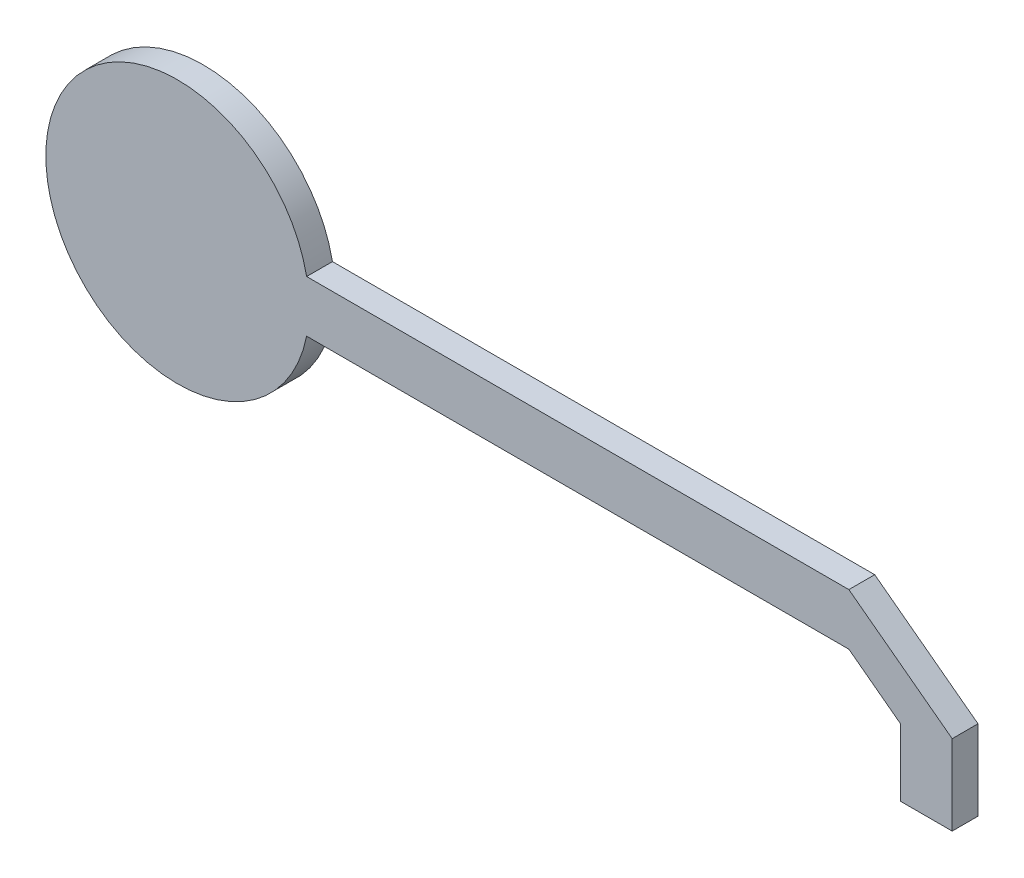
ISO-10303-21;
HEADER;
FILE_DESCRIPTION(('STEP AP214'),'2;1');
FILE_NAME('part.step','',(''),(''),'','','');
FILE_SCHEMA(('AUTOMOTIVE_DESIGN { 1 0 10303 214 1 1 1 1 }'));
ENDSEC;
DATA;
#1=APPLICATION_CONTEXT('core data for automotive mechanical design processes');
#2=APPLICATION_PROTOCOL_DEFINITION('international standard','automotive_design',2000,#1);
#3=PRODUCT_CONTEXT('',#1,'mechanical');
#4=PRODUCT('Part','Part','',(#3));
#5=PRODUCT_RELATED_PRODUCT_CATEGORY('part','',(#4));
#6=PRODUCT_DEFINITION_FORMATION('','',#4);
#7=PRODUCT_DEFINITION_CONTEXT('part definition',#1,'design');
#8=PRODUCT_DEFINITION('design','',#6,#7);
#9=PRODUCT_DEFINITION_SHAPE('','',#8);
#10=(LENGTH_UNIT() NAMED_UNIT(*) SI_UNIT(.MILLI.,.METRE.));
#11=(NAMED_UNIT(*) PLANE_ANGLE_UNIT() SI_UNIT($,.RADIAN.));
#12=(NAMED_UNIT(*) SI_UNIT($,.STERADIAN.) SOLID_ANGLE_UNIT());
#13=UNCERTAINTY_MEASURE_WITH_UNIT(LENGTH_MEASURE(1.E-05),#10,'distance_accuracy_value','');
#14=(GEOMETRIC_REPRESENTATION_CONTEXT(3) GLOBAL_UNCERTAINTY_ASSIGNED_CONTEXT((#13)) GLOBAL_UNIT_ASSIGNED_CONTEXT((#10,
#11,#12)) REPRESENTATION_CONTEXT('',''));
#15=CARTESIAN_POINT('',(0.,0.,0.));
#16=DIRECTION('',(0.,0.,1.));
#17=DIRECTION('',(1.,0.,0.));
#18=AXIS2_PLACEMENT_3D('',#15,#16,#17);
#19=CARTESIAN_POINT('',(-77.5024997500499,0.,5.));
#20=DIRECTION('',(0.,0.,-1.));
#21=DIRECTION('',(-1.,0.,0.));
#22=AXIS2_PLACEMENT_3D('',#19,#20,#21);
#23=CYLINDRICAL_SURFACE('',#22,25.5);
#24=CARTESIAN_POINT('',(-77.5024997500499,0.,0.));
#25=DIRECTION('',(0.,0.,1.));
#26=DIRECTION('',(1.,0.,0.));
#27=AXIS2_PLACEMENT_3D('',#24,#25,#26);
#28=CIRCLE('',#27,25.5);
#29=CARTESIAN_POINT('',(-52.4975002499499,5.,0.));
#30=VERTEX_POINT('',#29);
#31=CARTESIAN_POINT('',(-52.4975002499499,-5.,0.));
#32=VERTEX_POINT('',#31);
#33=EDGE_CURVE('E141',#30,#32,#28,.T.);
#34=ORIENTED_EDGE('',*,*,#33,.T.);
#35=DIRECTION('',(0.,0.,-1.));
#36=VECTOR('',#35,1.);
#37=CARTESIAN_POINT('',(-52.4975002499499,-5.,5.));
#38=LINE('',#37,#36);
#39=CARTESIAN_POINT('',(-52.4975002499499,-5.,5.));
#40=VERTEX_POINT('',#39);
#41=EDGE_CURVE('E183',#40,#32,#38,.T.);
#42=ORIENTED_EDGE('',*,*,#41,.F.);
#43=CARTESIAN_POINT('',(-77.5024997500499,0.,5.));
#44=DIRECTION('',(0.,0.,1.));
#45=DIRECTION('',(1.,0.,0.));
#46=AXIS2_PLACEMENT_3D('',#43,#44,#45);
#47=CIRCLE('',#46,25.5);
#48=CARTESIAN_POINT('',(-52.4975002499499,5.,5.));
#49=VERTEX_POINT('',#48);
#50=EDGE_CURVE('E164',#49,#40,#47,.T.);
#51=ORIENTED_EDGE('',*,*,#50,.F.);
#52=DIRECTION('',(0.,0.,-1.));
#53=VECTOR('',#52,1.);
#54=CARTESIAN_POINT('',(-52.4975002499499,5.,5.));
#55=LINE('',#54,#53);
#56=EDGE_CURVE('E137',#49,#30,#55,.T.);
#57=ORIENTED_EDGE('',*,*,#56,.T.);
#58=EDGE_LOOP('',(#34,#42,#51,#57));
#59=FACE_BOUND('',#58,.T.);
#60=ADVANCED_FACE('F39',(#59),#23,.T.);
#61=CARTESIAN_POINT('',(52.4975002499501,-5.,5.));
#62=DIRECTION('',(0.,1.,0.));
#63=DIRECTION('',(0.,0.,1.));
#64=AXIS2_PLACEMENT_3D('',#61,#62,#63);
#65=PLANE('',#64);
#66=DIRECTION('',(1.,0.,0.));
#67=VECTOR('',#66,1.);
#68=CARTESIAN_POINT('',(52.4975002499501,-5.,0.));
#69=LINE('',#68,#67);
#70=CARTESIAN_POINT('',(52.4975002499501,-5.,0.));
#71=VERTEX_POINT('',#70);
#72=EDGE_CURVE('E145',#32,#71,#69,.T.);
#73=ORIENTED_EDGE('',*,*,#72,.T.);
#74=DIRECTION('',(0.,0.,-1.));
#75=VECTOR('',#74,1.);
#76=CARTESIAN_POINT('',(52.4975002499501,-5.,5.));
#77=LINE('',#76,#75);
#78=CARTESIAN_POINT('',(52.4975002499501,-5.,5.));
#79=VERTEX_POINT('',#78);
#80=EDGE_CURVE('E179',#79,#71,#77,.T.);
#81=ORIENTED_EDGE('',*,*,#80,.F.);
#82=DIRECTION('',(1.,0.,0.));
#83=VECTOR('',#82,1.);
#84=CARTESIAN_POINT('',(52.4975002499501,-5.,5.));
#85=LINE('',#84,#83);
#86=EDGE_CURVE('E100',#40,#79,#85,.T.);
#87=ORIENTED_EDGE('',*,*,#86,.F.);
#88=ORIENTED_EDGE('',*,*,#41,.T.);
#89=EDGE_LOOP('',(#73,#81,#87,#88));
#90=FACE_BOUND('',#89,.T.);
#91=ADVANCED_FACE('F211',(#90),#65,.F.);
#92=CARTESIAN_POINT('',(52.4975002499501,-5.,5.));
#93=DIRECTION('',(0.6,0.8,0.));
#94=DIRECTION('',(-0.8,0.6,0.));
#95=AXIS2_PLACEMENT_3D('',#92,#93,#94);
#96=PLANE('',#95);
#97=DIRECTION('',(0.8,-0.6,0.));
#98=VECTOR('',#97,1.);
#99=CARTESIAN_POINT('',(52.4975002499501,-5.,0.));
#100=LINE('',#99,#98);
#101=CARTESIAN_POINT('',(62.4975002499501,-12.5,0.));
#102=VERTEX_POINT('',#101);
#103=EDGE_CURVE('E149',#71,#102,#100,.T.);
#104=ORIENTED_EDGE('',*,*,#103,.T.);
#105=DIRECTION('',(0.,0.,-1.));
#106=VECTOR('',#105,1.);
#107=CARTESIAN_POINT('',(62.4975002499501,-12.5,5.));
#108=LINE('',#107,#106);
#109=CARTESIAN_POINT('',(62.4975002499501,-12.5,5.));
#110=VERTEX_POINT('',#109);
#111=EDGE_CURVE('E175',#110,#102,#108,.T.);
#112=ORIENTED_EDGE('',*,*,#111,.F.);
#113=DIRECTION('',(0.8,-0.6,0.));
#114=VECTOR('',#113,1.);
#115=CARTESIAN_POINT('',(52.4975002499501,-5.,5.));
#116=LINE('',#115,#114);
#117=EDGE_CURVE('E311',#79,#110,#116,.T.);
#118=ORIENTED_EDGE('',*,*,#117,.F.);
#119=ORIENTED_EDGE('',*,*,#80,.T.);
#120=EDGE_LOOP('',(#104,#112,#118,#119));
#121=FACE_BOUND('',#120,.T.);
#122=ADVANCED_FACE('F215',(#121),#96,.F.);
#123=CARTESIAN_POINT('',(62.4975002499501,-25.5,5.));
#124=DIRECTION('',(1.,0.,0.));
#125=DIRECTION('',(0.,0.,-1.));
#126=AXIS2_PLACEMENT_3D('',#123,#124,#125);
#127=PLANE('',#126);
#128=DIRECTION('',(0.,-1.,0.));
#129=VECTOR('',#128,1.);
#130=CARTESIAN_POINT('',(62.4975002499501,-25.5,0.));
#131=LINE('',#130,#129);
#132=CARTESIAN_POINT('',(62.4975002499501,-25.5,0.));
#133=VERTEX_POINT('',#132);
#134=EDGE_CURVE('E152',#102,#133,#131,.T.);
#135=ORIENTED_EDGE('',*,*,#134,.T.);
#136=DIRECTION('',(0.,0.,-1.));
#137=VECTOR('',#136,1.);
#138=CARTESIAN_POINT('',(62.4975002499501,-25.5,5.));
#139=LINE('',#138,#137);
#140=CARTESIAN_POINT('',(62.4975002499501,-25.5,5.));
#141=VERTEX_POINT('',#140);
#142=EDGE_CURVE('E171',#141,#133,#139,.T.);
#143=ORIENTED_EDGE('',*,*,#142,.F.);
#144=DIRECTION('',(0.,-1.,0.));
#145=VECTOR('',#144,1.);
#146=CARTESIAN_POINT('',(62.4975002499501,-25.5,5.));
#147=LINE('',#146,#145);
#148=EDGE_CURVE('E314',#110,#141,#147,.T.);
#149=ORIENTED_EDGE('',*,*,#148,.F.);
#150=ORIENTED_EDGE('',*,*,#111,.T.);
#151=EDGE_LOOP('',(#135,#143,#149,#150));
#152=FACE_BOUND('',#151,.T.);
#153=ADVANCED_FACE('F219',(#152),#127,.F.);
#154=CARTESIAN_POINT('',(62.4975002499501,-25.5,5.));
#155=DIRECTION('',(0.,1.,0.));
#156=DIRECTION('',(0.,0.,1.));
#157=AXIS2_PLACEMENT_3D('',#154,#155,#156);
#158=PLANE('',#157);
#159=DIRECTION('',(1.,0.,0.));
#160=VECTOR('',#159,1.);
#161=CARTESIAN_POINT('',(62.4975002499501,-25.5,0.));
#162=LINE('',#161,#160);
#163=CARTESIAN_POINT('',(72.4975002499501,-25.5,0.));
#164=VERTEX_POINT('',#163);
#165=EDGE_CURVE('E155',#133,#164,#162,.T.);
#166=ORIENTED_EDGE('',*,*,#165,.T.);
#167=DIRECTION('',(0.,0.,-1.));
#168=VECTOR('',#167,1.);
#169=CARTESIAN_POINT('',(72.4975002499501,-25.5,5.));
#170=LINE('',#169,#168);
#171=CARTESIAN_POINT('',(72.4975002499501,-25.5,5.));
#172=VERTEX_POINT('',#171);
#173=EDGE_CURVE('E130',#172,#164,#170,.T.);
#174=ORIENTED_EDGE('',*,*,#173,.F.);
#175=DIRECTION('',(1.,0.,0.));
#176=VECTOR('',#175,1.);
#177=CARTESIAN_POINT('',(62.4975002499501,-25.5,5.));
#178=LINE('',#177,#176);
#179=EDGE_CURVE('E119',#141,#172,#178,.T.);
#180=ORIENTED_EDGE('',*,*,#179,.F.);
#181=ORIENTED_EDGE('',*,*,#142,.T.);
#182=EDGE_LOOP('',(#166,#174,#180,#181));
#183=FACE_BOUND('',#182,.T.);
#184=ADVANCED_FACE('F225',(#183),#158,.F.);
#185=CARTESIAN_POINT('',(72.4975002499501,-25.5,5.));
#186=DIRECTION('',(-1.,0.,0.));
#187=DIRECTION('',(0.,0.,1.));
#188=AXIS2_PLACEMENT_3D('',#185,#186,#187);
#189=PLANE('',#188);
#190=DIRECTION('',(0.,1.,0.));
#191=VECTOR('',#190,1.);
#192=CARTESIAN_POINT('',(72.4975002499501,-25.5,0.));
#193=LINE('',#192,#191);
#194=CARTESIAN_POINT('',(72.4975002499501,-10.,0.));
#195=VERTEX_POINT('',#194);
#196=EDGE_CURVE('E128',#164,#195,#193,.T.);
#197=ORIENTED_EDGE('',*,*,#196,.T.);
#198=DIRECTION('',(0.,0.,-1.));
#199=VECTOR('',#198,1.);
#200=CARTESIAN_POINT('',(72.4975002499501,-10.,5.));
#201=LINE('',#200,#199);
#202=CARTESIAN_POINT('',(72.4975002499501,-10.,5.));
#203=VERTEX_POINT('',#202);
#204=EDGE_CURVE('E125',#203,#195,#201,.T.);
#205=ORIENTED_EDGE('',*,*,#204,.F.);
#206=DIRECTION('',(0.,1.,0.));
#207=VECTOR('',#206,1.);
#208=CARTESIAN_POINT('',(72.4975002499501,-25.5,5.));
#209=LINE('',#208,#207);
#210=EDGE_CURVE('E113',#172,#203,#209,.T.);
#211=ORIENTED_EDGE('',*,*,#210,.F.);
#212=ORIENTED_EDGE('',*,*,#173,.T.);
#213=EDGE_LOOP('',(#197,#205,#211,#212));
#214=FACE_BOUND('',#213,.T.);
#215=ADVANCED_FACE('F126',(#214),#189,.F.);
#216=CARTESIAN_POINT('',(72.4975002499501,-10.,5.));
#217=DIRECTION('',(-0.6,-0.8,0.));
#218=DIRECTION('',(0.8,-0.6,0.));
#219=AXIS2_PLACEMENT_3D('',#216,#217,#218);
#220=PLANE('',#219);
#221=DIRECTION('',(-0.8,0.6,0.));
#222=VECTOR('',#221,1.);
#223=CARTESIAN_POINT('',(72.4975002499501,-10.,0.));
#224=LINE('',#223,#222);
#225=CARTESIAN_POINT('',(52.4975002499501,5.,0.));
#226=VERTEX_POINT('',#225);
#227=EDGE_CURVE('E85',#195,#226,#224,.T.);
#228=ORIENTED_EDGE('',*,*,#227,.T.);
#229=DIRECTION('',(0.,0.,-1.));
#230=VECTOR('',#229,1.);
#231=CARTESIAN_POINT('',(52.4975002499501,5.,5.));
#232=LINE('',#231,#230);
#233=CARTESIAN_POINT('',(52.4975002499501,5.,5.));
#234=VERTEX_POINT('',#233);
#235=EDGE_CURVE('E131',#234,#226,#232,.T.);
#236=ORIENTED_EDGE('',*,*,#235,.F.);
#237=DIRECTION('',(-0.8,0.6,0.));
#238=VECTOR('',#237,1.);
#239=CARTESIAN_POINT('',(72.4975002499501,-10.,5.));
#240=LINE('',#239,#238);
#241=EDGE_CURVE('E117',#203,#234,#240,.T.);
#242=ORIENTED_EDGE('',*,*,#241,.F.);
#243=ORIENTED_EDGE('',*,*,#204,.T.);
#244=EDGE_LOOP('',(#228,#236,#242,#243));
#245=FACE_BOUND('',#244,.T.);
#246=ADVANCED_FACE('F133',(#245),#220,.F.);
#247=CARTESIAN_POINT('',(-52.4975002499499,5.,5.));
#248=DIRECTION('',(0.,-1.,0.));
#249=DIRECTION('',(0.,0.,-1.));
#250=AXIS2_PLACEMENT_3D('',#247,#248,#249);
#251=PLANE('',#250);
#252=DIRECTION('',(-1.,0.,0.));
#253=VECTOR('',#252,1.);
#254=CARTESIAN_POINT('',(-52.4975002499499,5.,0.));
#255=LINE('',#254,#253);
#256=EDGE_CURVE('E91',#226,#30,#255,.T.);
#257=ORIENTED_EDGE('',*,*,#256,.T.);
#258=ORIENTED_EDGE('',*,*,#56,.F.);
#259=DIRECTION('',(-1.,0.,0.));
#260=VECTOR('',#259,1.);
#261=CARTESIAN_POINT('',(-52.4975002499499,5.,5.));
#262=LINE('',#261,#260);
#263=EDGE_CURVE('E56',#234,#49,#262,.T.);
#264=ORIENTED_EDGE('',*,*,#263,.F.);
#265=ORIENTED_EDGE('',*,*,#235,.T.);
#266=EDGE_LOOP('',(#257,#258,#264,#265));
#267=FACE_BOUND('',#266,.T.);
#268=ADVANCED_FACE('F201',(#267),#251,.F.);
#269=CARTESIAN_POINT('',(-77.5024997500499,0.,5.));
#270=DIRECTION('',(0.,0.,1.));
#271=DIRECTION('',(1.,0.,0.));
#272=AXIS2_PLACEMENT_3D('',#269,#270,#271);
#273=PLANE('',#272);
#274=ORIENTED_EDGE('',*,*,#50,.T.);
#275=ORIENTED_EDGE('',*,*,#86,.T.);
#276=ORIENTED_EDGE('',*,*,#117,.T.);
#277=ORIENTED_EDGE('',*,*,#148,.T.);
#278=ORIENTED_EDGE('',*,*,#179,.T.);
#279=ORIENTED_EDGE('',*,*,#210,.T.);
#280=ORIENTED_EDGE('',*,*,#241,.T.);
#281=ORIENTED_EDGE('',*,*,#263,.T.);
#282=EDGE_LOOP('',(#274,#275,#276,#277,#278,#279,#280,#281));
#283=FACE_BOUND('',#282,.T.);
#284=ADVANCED_FACE('F115',(#283),#273,.T.);
#285=CARTESIAN_POINT('',(-77.5024997500499,0.,0.));
#286=DIRECTION('',(0.,0.,1.));
#287=DIRECTION('',(1.,0.,0.));
#288=AXIS2_PLACEMENT_3D('',#285,#286,#287);
#289=PLANE('',#288);
#290=CARTESIAN_POINT('',(-77.5024997500499,0.,0.));
#291=DIRECTION('',(0.,0.,1.));
#292=DIRECTION('',(1.,0.,0.));
#293=AXIS2_PLACEMENT_3D('',#290,#291,#292);
#294=CIRCLE('',#293,5.);
#295=CARTESIAN_POINT('',(-72.5024997500499,0.,0.));
#296=VERTEX_POINT('',#295);
#297=EDGE_CURVE('E11',#296,#296,#294,.F.);
#298=ORIENTED_EDGE('',*,*,#297,.F.);
#299=EDGE_LOOP('',(#298));
#300=FACE_BOUND('',#299,.T.);
#301=CARTESIAN_POINT('',(-77.5024997500499,12.5,0.));
#302=DIRECTION('',(0.,0.,1.));
#303=DIRECTION('',(1.,0.,0.));
#304=AXIS2_PLACEMENT_3D('',#301,#302,#303);
#305=CIRCLE('',#304,2.50000000000001);
#306=CARTESIAN_POINT('',(-75.0024997500499,12.5,0.));
#307=VERTEX_POINT('',#306);
#308=EDGE_CURVE('E48',#307,#307,#305,.F.);
#309=ORIENTED_EDGE('',*,*,#308,.F.);
#310=EDGE_LOOP('',(#309));
#311=FACE_BOUND('',#310,.T.);
#312=ORIENTED_EDGE('',*,*,#33,.F.);
#313=ORIENTED_EDGE('',*,*,#256,.F.);
#314=ORIENTED_EDGE('',*,*,#227,.F.);
#315=ORIENTED_EDGE('',*,*,#196,.F.);
#316=ORIENTED_EDGE('',*,*,#165,.F.);
#317=ORIENTED_EDGE('',*,*,#134,.F.);
#318=ORIENTED_EDGE('',*,*,#103,.F.);
#319=ORIENTED_EDGE('',*,*,#72,.F.);
#320=EDGE_LOOP('',(#312,#313,#314,#315,#316,#317,#318,#319));
#321=FACE_BOUND('',#320,.T.);
#322=ADVANCED_FACE('F191',(#300,#311,#321),#289,.F.);
#323=CARTESIAN_POINT('',(-77.5024997500499,12.5,-5.));
#324=DIRECTION('',(0.,0.,1.));
#325=DIRECTION('',(1.,0.,0.));
#326=AXIS2_PLACEMENT_3D('',#323,#324,#325);
#327=CYLINDRICAL_SURFACE('',#326,2.50000000000001);
#328=CARTESIAN_POINT('',(-77.5024997500499,12.5,-5.));
#329=DIRECTION('',(0.,0.,-1.));
#330=DIRECTION('',(-1.,0.,0.));
#331=AXIS2_PLACEMENT_3D('',#328,#329,#330);
#332=CIRCLE('',#331,2.50000000000001);
#333=CARTESIAN_POINT('',(-80.0024997500499,12.5,-5.));
#334=VERTEX_POINT('',#333);
#335=EDGE_CURVE('E146',#334,#334,#332,.T.);
#336=ORIENTED_EDGE('',*,*,#335,.F.);
#337=EDGE_LOOP('',(#336));
#338=FACE_BOUND('',#337,.T.);
#339=ORIENTED_EDGE('',*,*,#308,.T.);
#340=EDGE_LOOP('',(#339));
#341=FACE_BOUND('',#340,.T.);
#342=ADVANCED_FACE('F189',(#338,#341),#327,.T.);
#343=CARTESIAN_POINT('',(-77.5024997500499,12.5,-5.));
#344=DIRECTION('',(0.,0.,-1.));
#345=DIRECTION('',(-1.,0.,0.));
#346=AXIS2_PLACEMENT_3D('',#343,#344,#345);
#347=PLANE('',#346);
#348=ORIENTED_EDGE('',*,*,#335,.T.);
#349=EDGE_LOOP('',(#348));
#350=FACE_BOUND('',#349,.T.);
#351=ADVANCED_FACE('F259',(#350),#347,.T.);
#352=CARTESIAN_POINT('',(-77.5024997500499,0.,-10.));
#353=DIRECTION('',(0.,0.,1.));
#354=DIRECTION('',(1.,0.,0.));
#355=AXIS2_PLACEMENT_3D('',#352,#353,#354);
#356=CYLINDRICAL_SURFACE('',#355,5.);
#357=CARTESIAN_POINT('',(-77.5024997500499,0.,-10.));
#358=DIRECTION('',(0.,0.,-1.));
#359=DIRECTION('',(-1.,0.,0.));
#360=AXIS2_PLACEMENT_3D('',#357,#358,#359);
#361=CIRCLE('',#360,5.);
#362=CARTESIAN_POINT('',(-82.5024997500499,0.,-10.));
#363=VERTEX_POINT('',#362);
#364=EDGE_CURVE('E300',#363,#363,#361,.T.);
#365=ORIENTED_EDGE('',*,*,#364,.F.);
#366=EDGE_LOOP('',(#365));
#367=FACE_BOUND('',#366,.T.);
#368=ORIENTED_EDGE('',*,*,#297,.T.);
#369=EDGE_LOOP('',(#368));
#370=FACE_BOUND('',#369,.T.);
#371=ADVANCED_FACE('F269',(#367,#370),#356,.T.);
#372=CARTESIAN_POINT('',(-77.5024997500499,0.,-10.));
#373=DIRECTION('',(0.,0.,-1.));
#374=DIRECTION('',(-1.,0.,0.));
#375=AXIS2_PLACEMENT_3D('',#372,#373,#374);
#376=PLANE('',#375);
#377=ORIENTED_EDGE('',*,*,#364,.T.);
#378=EDGE_LOOP('',(#377));
#379=FACE_BOUND('',#378,.T.);
#380=ADVANCED_FACE('F284',(#379),#376,.T.);
#381=CLOSED_SHELL('',(#60,#91,#122,#153,#184,#215,#246,#268,#284,#322,#342,#351,#371,#380));
#382=MANIFOLD_SOLID_BREP('B2',#381);
#383=ADVANCED_BREP_SHAPE_REPRESENTATION('',(#18,#382),#14);
#384=SHAPE_DEFINITION_REPRESENTATION(#9,#383);
ENDSEC;
END-ISO-10303-21;
